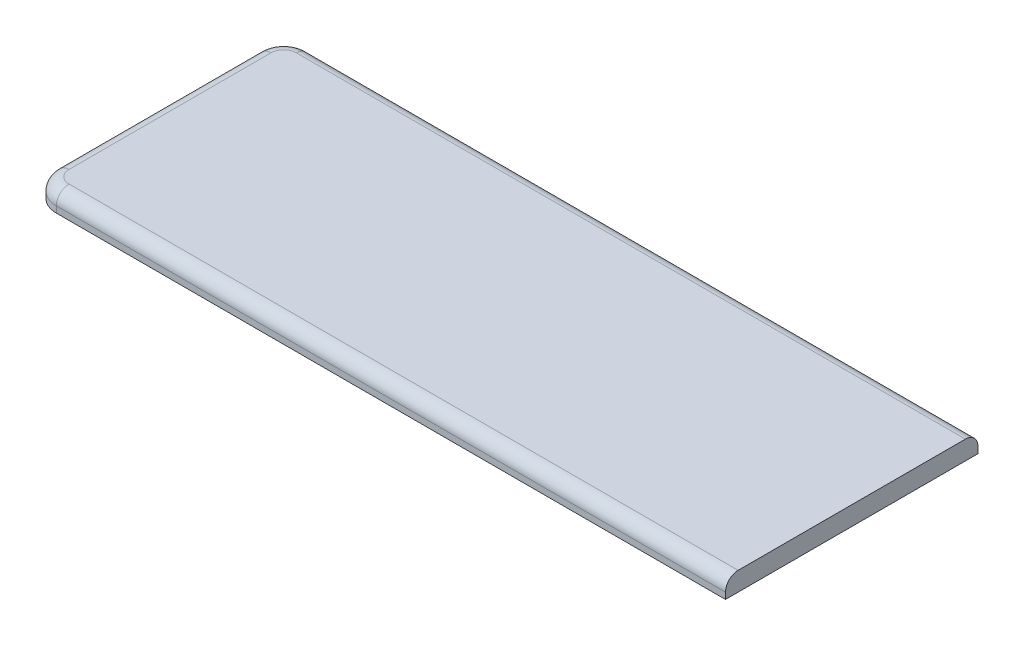
ISO-10303-21;
HEADER;
FILE_DESCRIPTION(('STEP AP214'),'2;1');
FILE_NAME('part.step','',(''),(''),'','','');
FILE_SCHEMA(('AUTOMOTIVE_DESIGN { 1 0 10303 214 1 1 1 1 }'));
ENDSEC;
DATA;
#1=APPLICATION_CONTEXT('core data for automotive mechanical design processes');
#2=APPLICATION_PROTOCOL_DEFINITION('international standard','automotive_design',2000,#1);
#3=PRODUCT_CONTEXT('',#1,'mechanical');
#4=PRODUCT('Part','Part','',(#3));
#5=PRODUCT_RELATED_PRODUCT_CATEGORY('part','',(#4));
#6=PRODUCT_DEFINITION_FORMATION('','',#4);
#7=PRODUCT_DEFINITION_CONTEXT('part definition',#1,'design');
#8=PRODUCT_DEFINITION('design','',#6,#7);
#9=PRODUCT_DEFINITION_SHAPE('','',#8);
#10=(LENGTH_UNIT() NAMED_UNIT(*) SI_UNIT(.MILLI.,.METRE.));
#11=(NAMED_UNIT(*) PLANE_ANGLE_UNIT() SI_UNIT($,.RADIAN.));
#12=(NAMED_UNIT(*) SI_UNIT($,.STERADIAN.) SOLID_ANGLE_UNIT());
#13=UNCERTAINTY_MEASURE_WITH_UNIT(LENGTH_MEASURE(1.E-05),#10,'distance_accuracy_value','');
#14=(GEOMETRIC_REPRESENTATION_CONTEXT(3) GLOBAL_UNCERTAINTY_ASSIGNED_CONTEXT((#13)) GLOBAL_UNIT_ASSIGNED_CONTEXT((#10,
#11,#12)) REPRESENTATION_CONTEXT('',''));
#15=CARTESIAN_POINT('',(0.,0.,0.));
#16=DIRECTION('',(0.,0.,1.));
#17=DIRECTION('',(1.,0.,0.));
#18=AXIS2_PLACEMENT_3D('',#15,#16,#17);
#19=CARTESIAN_POINT('',(-69.85,3.81,25.4));
#20=DIRECTION('',(1.,0.,0.));
#21=DIRECTION('',(0.,0.,-1.));
#22=AXIS2_PLACEMENT_3D('',#19,#20,#21);
#23=PLANE('',#22);
#24=DIRECTION('',(0.,-1.,0.));
#25=VECTOR('',#24,1.);
#26=CARTESIAN_POINT('',(-69.85,3.81,20.32));
#27=LINE('',#26,#25);
#28=CARTESIAN_POINT('',(-69.85,0.,20.32));
#29=VERTEX_POINT('',#28);
#30=CARTESIAN_POINT('',(-69.85,1.27,20.32));
#31=VERTEX_POINT('',#30);
#32=EDGE_CURVE('E116',#29,#31,#27,.F.);
#33=ORIENTED_EDGE('',*,*,#32,.T.);
#34=DIRECTION('',(0.,0.,1.));
#35=VECTOR('',#34,1.);
#36=CARTESIAN_POINT('',(-69.85,1.27,-20.32));
#37=LINE('',#36,#35);
#38=CARTESIAN_POINT('',(-69.85,1.27,-20.32));
#39=VERTEX_POINT('',#38);
#40=EDGE_CURVE('E166',#31,#39,#37,.F.);
#41=ORIENTED_EDGE('',*,*,#40,.T.);
#42=DIRECTION('',(0.,-1.,0.));
#43=VECTOR('',#42,1.);
#44=CARTESIAN_POINT('',(-69.85,3.81,-20.32));
#45=LINE('',#44,#43);
#46=CARTESIAN_POINT('',(-69.85,0.,-20.32));
#47=VERTEX_POINT('',#46);
#48=EDGE_CURVE('E138',#39,#47,#45,.T.);
#49=ORIENTED_EDGE('',*,*,#48,.T.);
#50=DIRECTION('',(0.,0.,1.));
#51=VECTOR('',#50,1.);
#52=CARTESIAN_POINT('',(-69.85,0.,25.4));
#53=LINE('',#52,#51);
#54=EDGE_CURVE('E125',#47,#29,#53,.T.);
#55=ORIENTED_EDGE('',*,*,#54,.T.);
#56=EDGE_LOOP('',(#33,#41,#49,#55));
#57=FACE_BOUND('',#56,.T.);
#58=ADVANCED_FACE('F35',(#57),#23,.F.);
#59=CARTESIAN_POINT('',(69.85,3.81,25.4));
#60=DIRECTION('',(0.,0.,-1.));
#61=DIRECTION('',(-1.,0.,0.));
#62=AXIS2_PLACEMENT_3D('',#59,#60,#61);
#63=PLANE('',#62);
#64=DIRECTION('',(0.,-1.,0.));
#65=VECTOR('',#64,1.);
#66=CARTESIAN_POINT('',(69.85,3.81,25.4));
#67=LINE('',#66,#65);
#68=CARTESIAN_POINT('',(69.85,1.27,25.4));
#69=VERTEX_POINT('',#68);
#70=CARTESIAN_POINT('',(69.85,0.,25.4));
#71=VERTEX_POINT('',#70);
#72=EDGE_CURVE('E106',#69,#71,#67,.T.);
#73=ORIENTED_EDGE('',*,*,#72,.F.);
#74=DIRECTION('',(1.,0.,0.));
#75=VECTOR('',#74,1.);
#76=CARTESIAN_POINT('',(-64.77,1.27,25.4));
#77=LINE('',#76,#75);
#78=CARTESIAN_POINT('',(-64.77,1.27,25.4));
#79=VERTEX_POINT('',#78);
#80=EDGE_CURVE('E11',#69,#79,#77,.F.);
#81=ORIENTED_EDGE('',*,*,#80,.T.);
#82=DIRECTION('',(0.,-1.,0.));
#83=VECTOR('',#82,1.);
#84=CARTESIAN_POINT('',(-64.77,3.81,25.4));
#85=LINE('',#84,#83);
#86=CARTESIAN_POINT('',(-64.77,0.,25.4));
#87=VERTEX_POINT('',#86);
#88=EDGE_CURVE('E122',#79,#87,#85,.T.);
#89=ORIENTED_EDGE('',*,*,#88,.T.);
#90=DIRECTION('',(1.,0.,0.));
#91=VECTOR('',#90,1.);
#92=CARTESIAN_POINT('',(69.85,0.,25.4));
#93=LINE('',#92,#91);
#94=EDGE_CURVE('E120',#87,#71,#93,.T.);
#95=ORIENTED_EDGE('',*,*,#94,.T.);
#96=EDGE_LOOP('',(#73,#81,#89,#95));
#97=FACE_BOUND('',#96,.T.);
#98=ADVANCED_FACE('F121',(#97),#63,.F.);
#99=CARTESIAN_POINT('',(69.85,3.81,25.4));
#100=DIRECTION('',(-1.,0.,0.));
#101=DIRECTION('',(0.,0.,1.));
#102=AXIS2_PLACEMENT_3D('',#99,#100,#101);
#103=PLANE('',#102);
#104=DIRECTION('',(0.,-1.,0.));
#105=VECTOR('',#104,1.);
#106=CARTESIAN_POINT('',(69.85,3.81,-25.4));
#107=LINE('',#106,#105);
#108=CARTESIAN_POINT('',(69.85,1.27,-25.4));
#109=VERTEX_POINT('',#108);
#110=CARTESIAN_POINT('',(69.85,0.,-25.4));
#111=VERTEX_POINT('',#110);
#112=EDGE_CURVE('E117',#109,#111,#107,.T.);
#113=ORIENTED_EDGE('',*,*,#112,.F.);
#114=CARTESIAN_POINT('',(69.85,1.27,-22.86));
#115=DIRECTION('',(-1.,0.,0.));
#116=DIRECTION('',(0.,0.,1.));
#117=AXIS2_PLACEMENT_3D('',#114,#115,#116);
#118=CIRCLE('',#117,2.54);
#119=CARTESIAN_POINT('',(69.85,3.81,-22.86));
#120=VERTEX_POINT('',#119);
#121=EDGE_CURVE('E162',#109,#120,#118,.F.);
#122=ORIENTED_EDGE('',*,*,#121,.T.);
#123=DIRECTION('',(0.,0.,-1.));
#124=VECTOR('',#123,1.);
#125=CARTESIAN_POINT('',(69.85,3.81,25.4));
#126=LINE('',#125,#124);
#127=CARTESIAN_POINT('',(69.85,3.81,22.86));
#128=VERTEX_POINT('',#127);
#129=EDGE_CURVE('E132',#128,#120,#126,.T.);
#130=ORIENTED_EDGE('',*,*,#129,.F.);
#131=CARTESIAN_POINT('',(69.85,1.27,22.86));
#132=DIRECTION('',(-1.,0.,0.));
#133=DIRECTION('',(0.,0.,1.));
#134=AXIS2_PLACEMENT_3D('',#131,#132,#133);
#135=CIRCLE('',#134,2.54);
#136=EDGE_CURVE('E115',#128,#69,#135,.F.);
#137=ORIENTED_EDGE('',*,*,#136,.T.);
#138=ORIENTED_EDGE('',*,*,#72,.T.);
#139=DIRECTION('',(0.,0.,-1.));
#140=VECTOR('',#139,1.);
#141=CARTESIAN_POINT('',(69.85,0.,25.4));
#142=LINE('',#141,#140);
#143=EDGE_CURVE('E111',#71,#111,#142,.T.);
#144=ORIENTED_EDGE('',*,*,#143,.T.);
#145=EDGE_LOOP('',(#113,#122,#130,#137,#138,#144));
#146=FACE_BOUND('',#145,.T.);
#147=ADVANCED_FACE('F109',(#146),#103,.F.);
#148=CARTESIAN_POINT('',(69.85,3.81,-25.4));
#149=DIRECTION('',(0.,0.,1.));
#150=DIRECTION('',(1.,0.,0.));
#151=AXIS2_PLACEMENT_3D('',#148,#149,#150);
#152=PLANE('',#151);
#153=DIRECTION('',(0.,-1.,0.));
#154=VECTOR('',#153,1.);
#155=CARTESIAN_POINT('',(-64.77,3.81,-25.4));
#156=LINE('',#155,#154);
#157=CARTESIAN_POINT('',(-64.77,0.,-25.4));
#158=VERTEX_POINT('',#157);
#159=CARTESIAN_POINT('',(-64.77,1.27,-25.4));
#160=VERTEX_POINT('',#159);
#161=EDGE_CURVE('E144',#158,#160,#156,.F.);
#162=ORIENTED_EDGE('',*,*,#161,.T.);
#163=DIRECTION('',(-1.,0.,0.));
#164=VECTOR('',#163,1.);
#165=CARTESIAN_POINT('',(69.85,1.27,-25.4));
#166=LINE('',#165,#164);
#167=EDGE_CURVE('E159',#160,#109,#166,.F.);
#168=ORIENTED_EDGE('',*,*,#167,.T.);
#169=ORIENTED_EDGE('',*,*,#112,.T.);
#170=DIRECTION('',(-1.,0.,0.));
#171=VECTOR('',#170,1.);
#172=CARTESIAN_POINT('',(69.85,0.,-25.4));
#173=LINE('',#172,#171);
#174=EDGE_CURVE('E130',#111,#158,#173,.T.);
#175=ORIENTED_EDGE('',*,*,#174,.T.);
#176=EDGE_LOOP('',(#162,#168,#169,#175));
#177=FACE_BOUND('',#176,.T.);
#178=ADVANCED_FACE('F208',(#177),#152,.F.);
#179=CARTESIAN_POINT('',(0.,3.81,0.));
#180=DIRECTION('',(0.,1.,0.));
#181=DIRECTION('',(0.,0.,1.));
#182=AXIS2_PLACEMENT_3D('',#179,#180,#181);
#183=PLANE('',#182);
#184=ORIENTED_EDGE('',*,*,#129,.T.);
#185=DIRECTION('',(-1.,0.,0.));
#186=VECTOR('',#185,1.);
#187=CARTESIAN_POINT('',(-64.77,3.81,-22.86));
#188=LINE('',#187,#186);
#189=CARTESIAN_POINT('',(-64.77,3.81,-22.86));
#190=VERTEX_POINT('',#189);
#191=EDGE_CURVE('E156',#120,#190,#188,.T.);
#192=ORIENTED_EDGE('',*,*,#191,.T.);
#193=CARTESIAN_POINT('',(-64.77,3.81,-20.32));
#194=DIRECTION('',(0.,1.,0.));
#195=DIRECTION('',(0.,0.,1.));
#196=AXIS2_PLACEMENT_3D('',#193,#194,#195);
#197=CIRCLE('',#196,2.54);
#198=CARTESIAN_POINT('',(-67.31,3.81,-20.32));
#199=VERTEX_POINT('',#198);
#200=EDGE_CURVE('E154',#190,#199,#197,.T.);
#201=ORIENTED_EDGE('',*,*,#200,.T.);
#202=DIRECTION('',(0.,0.,1.));
#203=VECTOR('',#202,1.);
#204=CARTESIAN_POINT('',(-67.31,3.81,20.32));
#205=LINE('',#204,#203);
#206=CARTESIAN_POINT('',(-67.31,3.81,20.32));
#207=VERTEX_POINT('',#206);
#208=EDGE_CURVE('E152',#199,#207,#205,.T.);
#209=ORIENTED_EDGE('',*,*,#208,.T.);
#210=CARTESIAN_POINT('',(-64.77,3.81,20.32));
#211=DIRECTION('',(0.,1.,0.));
#212=DIRECTION('',(0.,0.,1.));
#213=AXIS2_PLACEMENT_3D('',#210,#211,#212);
#214=CIRCLE('',#213,2.54);
#215=CARTESIAN_POINT('',(-64.77,3.81,22.86));
#216=VERTEX_POINT('',#215);
#217=EDGE_CURVE('E150',#207,#216,#214,.T.);
#218=ORIENTED_EDGE('',*,*,#217,.T.);
#219=DIRECTION('',(1.,0.,0.));
#220=VECTOR('',#219,1.);
#221=CARTESIAN_POINT('',(69.85,3.81,22.86));
#222=LINE('',#221,#220);
#223=EDGE_CURVE('E148',#216,#128,#222,.T.);
#224=ORIENTED_EDGE('',*,*,#223,.T.);
#225=EDGE_LOOP('',(#184,#192,#201,#209,#218,#224));
#226=FACE_BOUND('',#225,.T.);
#227=ADVANCED_FACE('F189',(#226),#183,.T.);
#228=CARTESIAN_POINT('',(0.,0.,0.));
#229=DIRECTION('',(0.,1.,0.));
#230=DIRECTION('',(0.,0.,1.));
#231=AXIS2_PLACEMENT_3D('',#228,#229,#230);
#232=PLANE('',#231);
#233=ORIENTED_EDGE('',*,*,#54,.F.);
#234=CARTESIAN_POINT('',(-64.77,0.,-20.32));
#235=DIRECTION('',(0.,1.,0.));
#236=DIRECTION('',(0.,0.,1.));
#237=AXIS2_PLACEMENT_3D('',#234,#235,#236);
#238=CIRCLE('',#237,5.08);
#239=EDGE_CURVE('E142',#47,#158,#238,.F.);
#240=ORIENTED_EDGE('',*,*,#239,.T.);
#241=ORIENTED_EDGE('',*,*,#174,.F.);
#242=ORIENTED_EDGE('',*,*,#143,.F.);
#243=ORIENTED_EDGE('',*,*,#94,.F.);
#244=CARTESIAN_POINT('',(-64.77,0.,20.32));
#245=DIRECTION('',(0.,1.,0.));
#246=DIRECTION('',(0.,0.,1.));
#247=AXIS2_PLACEMENT_3D('',#244,#245,#246);
#248=CIRCLE('',#247,5.08);
#249=EDGE_CURVE('E140',#87,#29,#248,.F.);
#250=ORIENTED_EDGE('',*,*,#249,.T.);
#251=EDGE_LOOP('',(#233,#240,#241,#242,#243,#250));
#252=FACE_BOUND('',#251,.T.);
#253=ADVANCED_FACE('F128',(#252),#232,.F.);
#254=CARTESIAN_POINT('',(-64.77,3.81,-20.32));
#255=DIRECTION('',(0.,-1.,0.));
#256=DIRECTION('',(0.,0.,-1.));
#257=AXIS2_PLACEMENT_3D('',#254,#255,#256);
#258=CYLINDRICAL_SURFACE('',#257,5.08);
#259=ORIENTED_EDGE('',*,*,#48,.F.);
#260=CARTESIAN_POINT('',(-64.77,1.27,-20.32));
#261=DIRECTION('',(0.,1.,0.));
#262=DIRECTION('',(0.,0.,1.));
#263=AXIS2_PLACEMENT_3D('',#260,#261,#262);
#264=CIRCLE('',#263,5.08);
#265=EDGE_CURVE('E164',#39,#160,#264,.F.);
#266=ORIENTED_EDGE('',*,*,#265,.T.);
#267=ORIENTED_EDGE('',*,*,#161,.F.);
#268=ORIENTED_EDGE('',*,*,#239,.F.);
#269=EDGE_LOOP('',(#259,#266,#267,#268));
#270=FACE_BOUND('',#269,.T.);
#271=ADVANCED_FACE('F205',(#270),#258,.T.);
#272=CARTESIAN_POINT('',(-64.77,3.81,20.32));
#273=DIRECTION('',(0.,-1.,0.));
#274=DIRECTION('',(0.,0.,-1.));
#275=AXIS2_PLACEMENT_3D('',#272,#273,#274);
#276=CYLINDRICAL_SURFACE('',#275,5.08);
#277=ORIENTED_EDGE('',*,*,#88,.F.);
#278=CARTESIAN_POINT('',(-64.77,1.27,20.32));
#279=DIRECTION('',(0.,1.,0.));
#280=DIRECTION('',(0.,0.,1.));
#281=AXIS2_PLACEMENT_3D('',#278,#279,#280);
#282=CIRCLE('',#281,5.08);
#283=EDGE_CURVE('E44',#79,#31,#282,.F.);
#284=ORIENTED_EDGE('',*,*,#283,.T.);
#285=ORIENTED_EDGE('',*,*,#32,.F.);
#286=ORIENTED_EDGE('',*,*,#249,.F.);
#287=EDGE_LOOP('',(#277,#284,#285,#286));
#288=FACE_BOUND('',#287,.T.);
#289=ADVANCED_FACE('F227',(#288),#276,.T.);
#290=CARTESIAN_POINT('',(0.,1.27,22.86));
#291=DIRECTION('',(-1.,0.,0.));
#292=DIRECTION('',(0.,0.,1.));
#293=AXIS2_PLACEMENT_3D('',#290,#291,#292);
#294=CYLINDRICAL_SURFACE('',#293,2.54);
#295=ORIENTED_EDGE('',*,*,#136,.F.);
#296=ORIENTED_EDGE('',*,*,#223,.F.);
#297=CARTESIAN_POINT('',(-64.77,1.27,22.86));
#298=DIRECTION('',(-1.,0.,0.));
#299=DIRECTION('',(0.,0.,1.));
#300=AXIS2_PLACEMENT_3D('',#297,#298,#299);
#301=CIRCLE('',#300,2.54);
#302=EDGE_CURVE('E39',#79,#216,#301,.T.);
#303=ORIENTED_EDGE('',*,*,#302,.F.);
#304=ORIENTED_EDGE('',*,*,#80,.F.);
#305=EDGE_LOOP('',(#295,#296,#303,#304));
#306=FACE_BOUND('',#305,.T.);
#307=ADVANCED_FACE('F37',(#306),#294,.T.);
#308=CARTESIAN_POINT('',(-64.77,1.27,20.32));
#309=DIRECTION('',(0.,1.,0.));
#310=DIRECTION('',(0.,0.,1.));
#311=AXIS2_PLACEMENT_3D('',#308,#309,#310);
#312=DEGENERATE_TOROIDAL_SURFACE('',#311,2.54,2.54,.T.);
#313=ORIENTED_EDGE('',*,*,#302,.T.);
#314=ORIENTED_EDGE('',*,*,#217,.F.);
#315=CARTESIAN_POINT('',(-67.31,1.27,20.32));
#316=DIRECTION('',(0.,0.,-1.));
#317=DIRECTION('',(-1.,0.,0.));
#318=AXIS2_PLACEMENT_3D('',#315,#316,#317);
#319=CIRCLE('',#318,2.54);
#320=EDGE_CURVE('E173',#31,#207,#319,.T.);
#321=ORIENTED_EDGE('',*,*,#320,.F.);
#322=ORIENTED_EDGE('',*,*,#283,.F.);
#323=EDGE_LOOP('',(#313,#314,#321,#322));
#324=FACE_BOUND('',#323,.T.);
#325=ADVANCED_FACE('F235',(#324),#312,.T.);
#326=CARTESIAN_POINT('',(-67.31,1.27,0.));
#327=DIRECTION('',(0.,0.,-1.));
#328=DIRECTION('',(-1.,0.,0.));
#329=AXIS2_PLACEMENT_3D('',#326,#327,#328);
#330=CYLINDRICAL_SURFACE('',#329,2.54);
#331=ORIENTED_EDGE('',*,*,#320,.T.);
#332=ORIENTED_EDGE('',*,*,#208,.F.);
#333=CARTESIAN_POINT('',(-67.31,1.27,-20.32));
#334=DIRECTION('',(0.,0.,-1.));
#335=DIRECTION('',(-1.,0.,0.));
#336=AXIS2_PLACEMENT_3D('',#333,#334,#335);
#337=CIRCLE('',#336,2.54);
#338=EDGE_CURVE('E171',#39,#199,#337,.T.);
#339=ORIENTED_EDGE('',*,*,#338,.F.);
#340=ORIENTED_EDGE('',*,*,#40,.F.);
#341=EDGE_LOOP('',(#331,#332,#339,#340));
#342=FACE_BOUND('',#341,.T.);
#343=ADVANCED_FACE('F201',(#342),#330,.T.);
#344=CARTESIAN_POINT('',(-64.77,1.27,-20.32));
#345=DIRECTION('',(0.,1.,0.));
#346=DIRECTION('',(0.,0.,1.));
#347=AXIS2_PLACEMENT_3D('',#344,#345,#346);
#348=DEGENERATE_TOROIDAL_SURFACE('',#347,2.54,2.54,.T.);
#349=ORIENTED_EDGE('',*,*,#338,.T.);
#350=ORIENTED_EDGE('',*,*,#200,.F.);
#351=CARTESIAN_POINT('',(-64.77,1.27,-22.86));
#352=DIRECTION('',(1.,0.,0.));
#353=DIRECTION('',(0.,0.,-1.));
#354=AXIS2_PLACEMENT_3D('',#351,#352,#353);
#355=CIRCLE('',#354,2.54);
#356=EDGE_CURVE('E169',#160,#190,#355,.T.);
#357=ORIENTED_EDGE('',*,*,#356,.F.);
#358=ORIENTED_EDGE('',*,*,#265,.F.);
#359=EDGE_LOOP('',(#349,#350,#357,#358));
#360=FACE_BOUND('',#359,.T.);
#361=ADVANCED_FACE('F199',(#360),#348,.T.);
#362=CARTESIAN_POINT('',(0.,1.27,-22.86));
#363=DIRECTION('',(1.,0.,0.));
#364=DIRECTION('',(0.,0.,-1.));
#365=AXIS2_PLACEMENT_3D('',#362,#363,#364);
#366=CYLINDRICAL_SURFACE('',#365,2.54);
#367=ORIENTED_EDGE('',*,*,#121,.F.);
#368=ORIENTED_EDGE('',*,*,#167,.F.);
#369=ORIENTED_EDGE('',*,*,#356,.T.);
#370=ORIENTED_EDGE('',*,*,#191,.F.);
#371=EDGE_LOOP('',(#367,#368,#369,#370));
#372=FACE_BOUND('',#371,.T.);
#373=ADVANCED_FACE('F193',(#372),#366,.T.);
#374=CLOSED_SHELL('',(#58,#98,#147,#178,#227,#253,#271,#289,#307,#325,#343,#361,#373));
#375=MANIFOLD_SOLID_BREP('B2',#374);
#376=ADVANCED_BREP_SHAPE_REPRESENTATION('',(#18,#375),#14);
#377=SHAPE_DEFINITION_REPRESENTATION(#9,#376);
ENDSEC;
END-ISO-10303-21;
